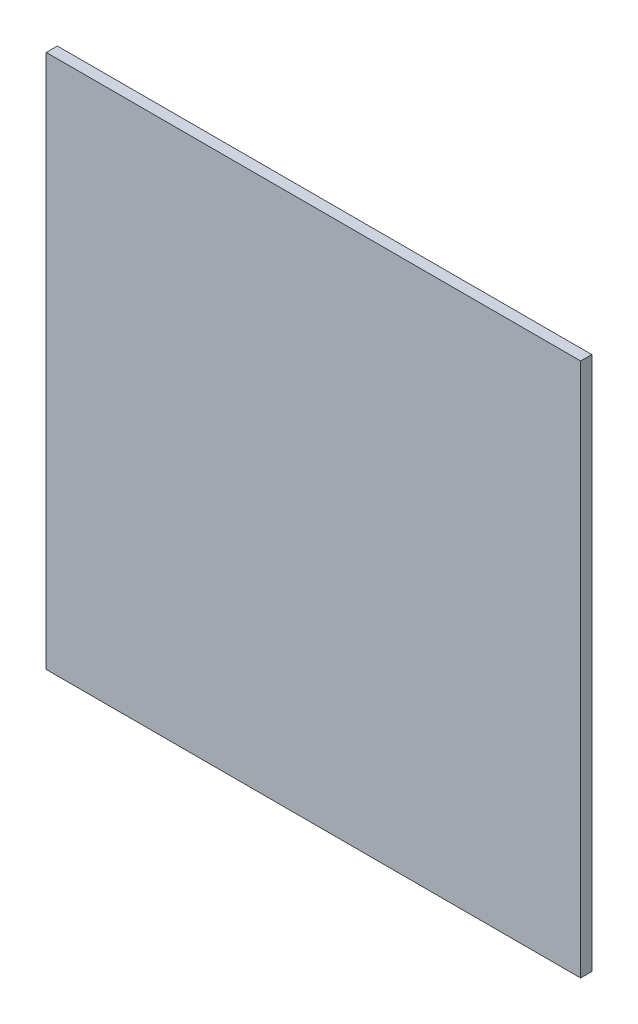
ISO-10303-21;
HEADER;
FILE_DESCRIPTION(('STEP AP214'),'2;1');
FILE_NAME('part.step','',(''),(''),'','','');
FILE_SCHEMA(('AUTOMOTIVE_DESIGN { 1 0 10303 214 1 1 1 1 }'));
ENDSEC;
DATA;
#1=APPLICATION_CONTEXT('core data for automotive mechanical design processes');
#2=APPLICATION_PROTOCOL_DEFINITION('international standard','automotive_design',2000,#1);
#3=PRODUCT_CONTEXT('',#1,'mechanical');
#4=PRODUCT('Part','Part','',(#3));
#5=PRODUCT_RELATED_PRODUCT_CATEGORY('part','',(#4));
#6=PRODUCT_DEFINITION_FORMATION('','',#4);
#7=PRODUCT_DEFINITION_CONTEXT('part definition',#1,'design');
#8=PRODUCT_DEFINITION('design','',#6,#7);
#9=PRODUCT_DEFINITION_SHAPE('','',#8);
#10=(LENGTH_UNIT() NAMED_UNIT(*) SI_UNIT(.MILLI.,.METRE.));
#11=(NAMED_UNIT(*) PLANE_ANGLE_UNIT() SI_UNIT($,.RADIAN.));
#12=(NAMED_UNIT(*) SI_UNIT($,.STERADIAN.) SOLID_ANGLE_UNIT());
#13=UNCERTAINTY_MEASURE_WITH_UNIT(LENGTH_MEASURE(1.E-05),#10,'distance_accuracy_value','');
#14=(GEOMETRIC_REPRESENTATION_CONTEXT(3) GLOBAL_UNCERTAINTY_ASSIGNED_CONTEXT((#13)) GLOBAL_UNIT_ASSIGNED_CONTEXT((#10,
#11,#12)) REPRESENTATION_CONTEXT('',''));
#15=CARTESIAN_POINT('',(0.,0.,0.));
#16=DIRECTION('',(0.,0.,1.));
#17=DIRECTION('',(1.,0.,0.));
#18=AXIS2_PLACEMENT_3D('',#15,#16,#17);
#19=CARTESIAN_POINT('',(0.,0.,12.7));
#20=DIRECTION('',(1.,0.,0.));
#21=DIRECTION('',(0.,0.,-1.));
#22=AXIS2_PLACEMENT_3D('',#19,#20,#21);
#23=PLANE('',#22);
#24=DIRECTION('',(0.,-1.,0.));
#25=VECTOR('',#24,1.);
#26=CARTESIAN_POINT('',(0.,0.,0.));
#27=LINE('',#26,#25);
#28=CARTESIAN_POINT('',(0.,609.6,0.));
#29=VERTEX_POINT('',#28);
#30=CARTESIAN_POINT('',(0.,0.,0.));
#31=VERTEX_POINT('',#30);
#32=EDGE_CURVE('E111',#29,#31,#27,.T.);
#33=ORIENTED_EDGE('',*,*,#32,.T.);
#34=DIRECTION('',(0.,0.,-1.));
#35=VECTOR('',#34,1.);
#36=CARTESIAN_POINT('',(0.,0.,12.7));
#37=LINE('',#36,#35);
#38=CARTESIAN_POINT('',(0.,0.,12.7));
#39=VERTEX_POINT('',#38);
#40=EDGE_CURVE('E11',#39,#31,#37,.T.);
#41=ORIENTED_EDGE('',*,*,#40,.F.);
#42=DIRECTION('',(0.,-1.,0.));
#43=VECTOR('',#42,1.);
#44=CARTESIAN_POINT('',(0.,0.,12.7));
#45=LINE('',#44,#43);
#46=CARTESIAN_POINT('',(0.,609.6,12.7));
#47=VERTEX_POINT('',#46);
#48=EDGE_CURVE('E95',#47,#39,#45,.T.);
#49=ORIENTED_EDGE('',*,*,#48,.F.);
#50=DIRECTION('',(0.,0.,-1.));
#51=VECTOR('',#50,1.);
#52=CARTESIAN_POINT('',(0.,609.6,12.7));
#53=LINE('',#52,#51);
#54=EDGE_CURVE('E107',#47,#29,#53,.T.);
#55=ORIENTED_EDGE('',*,*,#54,.T.);
#56=EDGE_LOOP('',(#33,#41,#49,#55));
#57=FACE_BOUND('',#56,.T.);
#58=ADVANCED_FACE('F43',(#57),#23,.F.);
#59=CARTESIAN_POINT('',(0.,0.,12.7));
#60=DIRECTION('',(0.,1.,0.));
#61=DIRECTION('',(0.,0.,1.));
#62=AXIS2_PLACEMENT_3D('',#59,#60,#61);
#63=PLANE('',#62);
#64=DIRECTION('',(1.,0.,0.));
#65=VECTOR('',#64,1.);
#66=CARTESIAN_POINT('',(0.,0.,0.));
#67=LINE('',#66,#65);
#68=CARTESIAN_POINT('',(609.6,0.,0.));
#69=VERTEX_POINT('',#68);
#70=EDGE_CURVE('E100',#31,#69,#67,.T.);
#71=ORIENTED_EDGE('',*,*,#70,.T.);
#72=DIRECTION('',(0.,0.,-1.));
#73=VECTOR('',#72,1.);
#74=CARTESIAN_POINT('',(609.6,0.,12.7));
#75=LINE('',#74,#73);
#76=CARTESIAN_POINT('',(609.6,0.,12.7));
#77=VERTEX_POINT('',#76);
#78=EDGE_CURVE('E52',#77,#69,#75,.T.);
#79=ORIENTED_EDGE('',*,*,#78,.F.);
#80=DIRECTION('',(1.,0.,0.));
#81=VECTOR('',#80,1.);
#82=CARTESIAN_POINT('',(0.,0.,12.7));
#83=LINE('',#82,#81);
#84=EDGE_CURVE('E90',#39,#77,#83,.T.);
#85=ORIENTED_EDGE('',*,*,#84,.F.);
#86=ORIENTED_EDGE('',*,*,#40,.T.);
#87=EDGE_LOOP('',(#71,#79,#85,#86));
#88=FACE_BOUND('',#87,.T.);
#89=ADVANCED_FACE('F99',(#88),#63,.F.);
#90=CARTESIAN_POINT('',(609.6,0.,12.7));
#91=DIRECTION('',(-1.,0.,0.));
#92=DIRECTION('',(0.,0.,1.));
#93=AXIS2_PLACEMENT_3D('',#90,#91,#92);
#94=PLANE('',#93);
#95=DIRECTION('',(0.,1.,0.));
#96=VECTOR('',#95,1.);
#97=CARTESIAN_POINT('',(609.6,0.,0.));
#98=LINE('',#97,#96);
#99=CARTESIAN_POINT('',(609.6,609.6,0.));
#100=VERTEX_POINT('',#99);
#101=EDGE_CURVE('E77',#69,#100,#98,.T.);
#102=ORIENTED_EDGE('',*,*,#101,.T.);
#103=DIRECTION('',(0.,0.,-1.));
#104=VECTOR('',#103,1.);
#105=CARTESIAN_POINT('',(609.6,609.6,12.7));
#106=LINE('',#105,#104);
#107=CARTESIAN_POINT('',(609.6,609.6,12.7));
#108=VERTEX_POINT('',#107);
#109=EDGE_CURVE('E102',#108,#100,#106,.T.);
#110=ORIENTED_EDGE('',*,*,#109,.F.);
#111=DIRECTION('',(0.,1.,0.));
#112=VECTOR('',#111,1.);
#113=CARTESIAN_POINT('',(609.6,0.,12.7));
#114=LINE('',#113,#112);
#115=EDGE_CURVE('E93',#77,#108,#114,.T.);
#116=ORIENTED_EDGE('',*,*,#115,.F.);
#117=ORIENTED_EDGE('',*,*,#78,.T.);
#118=EDGE_LOOP('',(#102,#110,#116,#117));
#119=FACE_BOUND('',#118,.T.);
#120=ADVANCED_FACE('F103',(#119),#94,.F.);
#121=CARTESIAN_POINT('',(0.,609.6,12.7));
#122=DIRECTION('',(0.,-1.,0.));
#123=DIRECTION('',(0.,0.,-1.));
#124=AXIS2_PLACEMENT_3D('',#121,#122,#123);
#125=PLANE('',#124);
#126=DIRECTION('',(-1.,0.,0.));
#127=VECTOR('',#126,1.);
#128=CARTESIAN_POINT('',(0.,609.6,0.));
#129=LINE('',#128,#127);
#130=EDGE_CURVE('E83',#100,#29,#129,.T.);
#131=ORIENTED_EDGE('',*,*,#130,.T.);
#132=ORIENTED_EDGE('',*,*,#54,.F.);
#133=DIRECTION('',(-1.,0.,0.));
#134=VECTOR('',#133,1.);
#135=CARTESIAN_POINT('',(0.,609.6,12.7));
#136=LINE('',#135,#134);
#137=EDGE_CURVE('E60',#108,#47,#136,.T.);
#138=ORIENTED_EDGE('',*,*,#137,.F.);
#139=ORIENTED_EDGE('',*,*,#109,.T.);
#140=EDGE_LOOP('',(#131,#132,#138,#139));
#141=FACE_BOUND('',#140,.T.);
#142=ADVANCED_FACE('F124',(#141),#125,.F.);
#143=CARTESIAN_POINT('',(0.,0.,12.7));
#144=DIRECTION('',(0.,0.,-1.));
#145=DIRECTION('',(-1.,0.,0.));
#146=AXIS2_PLACEMENT_3D('',#143,#144,#145);
#147=PLANE('',#146);
#148=ORIENTED_EDGE('',*,*,#48,.T.);
#149=ORIENTED_EDGE('',*,*,#84,.T.);
#150=ORIENTED_EDGE('',*,*,#115,.T.);
#151=ORIENTED_EDGE('',*,*,#137,.T.);
#152=EDGE_LOOP('',(#148,#149,#150,#151));
#153=FACE_BOUND('',#152,.T.);
#154=ADVANCED_FACE('F91',(#153),#147,.F.);
#155=CARTESIAN_POINT('',(0.,0.,0.));
#156=DIRECTION('',(0.,0.,-1.));
#157=DIRECTION('',(-1.,0.,0.));
#158=AXIS2_PLACEMENT_3D('',#155,#156,#157);
#159=PLANE('',#158);
#160=ORIENTED_EDGE('',*,*,#32,.F.);
#161=ORIENTED_EDGE('',*,*,#130,.F.);
#162=ORIENTED_EDGE('',*,*,#101,.F.);
#163=ORIENTED_EDGE('',*,*,#70,.F.);
#164=EDGE_LOOP('',(#160,#161,#162,#163));
#165=FACE_BOUND('',#164,.T.);
#166=ADVANCED_FACE('F127',(#165),#159,.T.);
#167=CLOSED_SHELL('',(#58,#89,#120,#142,#154,#166));
#168=MANIFOLD_SOLID_BREP('B2',#167);
#169=ADVANCED_BREP_SHAPE_REPRESENTATION('',(#18,#168),#14);
#170=SHAPE_DEFINITION_REPRESENTATION(#9,#169);
ENDSEC;
END-ISO-10303-21;
